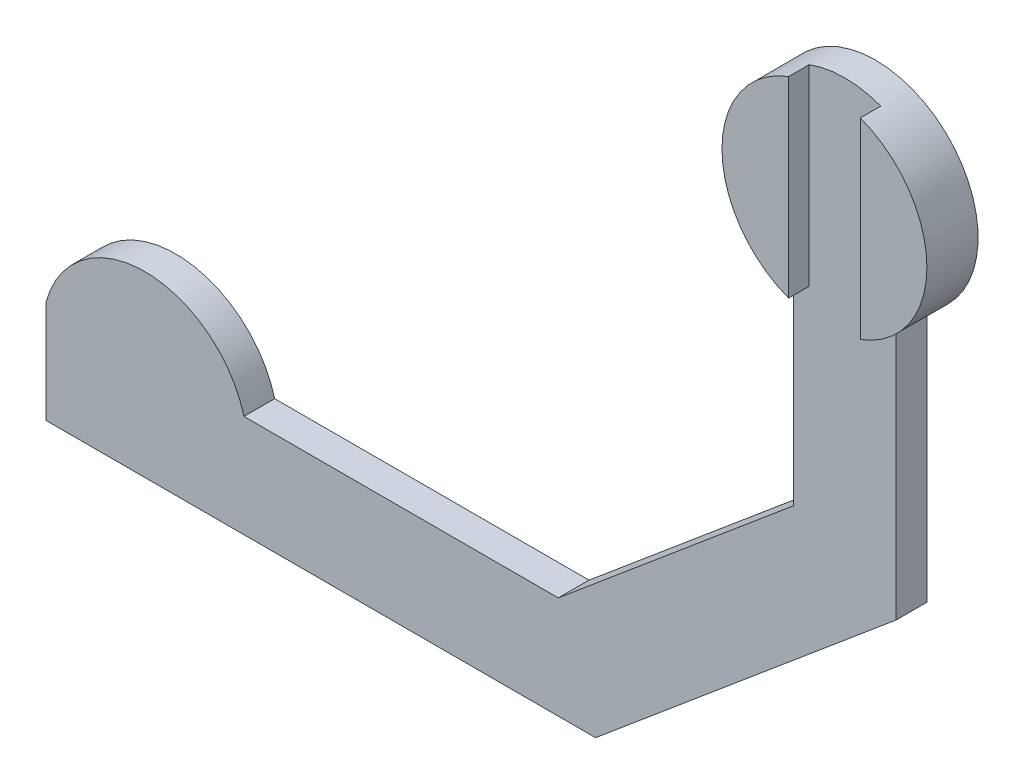
ISO-10303-21;
HEADER;
FILE_DESCRIPTION(('STEP AP214'),'2;1');
FILE_NAME('part.step','',(''),(''),'','','');
FILE_SCHEMA(('AUTOMOTIVE_DESIGN { 1 0 10303 214 1 1 1 1 }'));
ENDSEC;
DATA;
#1=APPLICATION_CONTEXT('core data for automotive mechanical design processes');
#2=APPLICATION_PROTOCOL_DEFINITION('international standard','automotive_design',2000,#1);
#3=PRODUCT_CONTEXT('',#1,'mechanical');
#4=PRODUCT('Part','Part','',(#3));
#5=PRODUCT_RELATED_PRODUCT_CATEGORY('part','',(#4));
#6=PRODUCT_DEFINITION_FORMATION('','',#4);
#7=PRODUCT_DEFINITION_CONTEXT('part definition',#1,'design');
#8=PRODUCT_DEFINITION('design','',#6,#7);
#9=PRODUCT_DEFINITION_SHAPE('','',#8);
#10=(LENGTH_UNIT() NAMED_UNIT(*) SI_UNIT(.MILLI.,.METRE.));
#11=(NAMED_UNIT(*) PLANE_ANGLE_UNIT() SI_UNIT($,.RADIAN.));
#12=(NAMED_UNIT(*) SI_UNIT($,.STERADIAN.) SOLID_ANGLE_UNIT());
#13=UNCERTAINTY_MEASURE_WITH_UNIT(LENGTH_MEASURE(1.E-05),#10,'distance_accuracy_value','');
#14=(GEOMETRIC_REPRESENTATION_CONTEXT(3) GLOBAL_UNCERTAINTY_ASSIGNED_CONTEXT((#13)) GLOBAL_UNIT_ASSIGNED_CONTEXT((#10,
#11,#12)) REPRESENTATION_CONTEXT('',''));
#15=CARTESIAN_POINT('',(0.,0.,0.));
#16=DIRECTION('',(0.,0.,1.));
#17=DIRECTION('',(1.,0.,0.));
#18=AXIS2_PLACEMENT_3D('',#15,#16,#17);
#19=CARTESIAN_POINT('',(0.,0.,3.));
#20=DIRECTION('',(0.,0.,1.));
#21=DIRECTION('',(1.,0.,0.));
#22=AXIS2_PLACEMENT_3D('',#19,#20,#21);
#23=PLANE('',#22);
#24=CARTESIAN_POINT('',(0.,0.,3.));
#25=DIRECTION('',(0.,0.,1.));
#26=DIRECTION('',(1.,0.,0.));
#27=AXIS2_PLACEMENT_3D('',#24,#25,#26);
#28=CIRCLE('',#27,10.);
#29=CARTESIAN_POINT('',(3.5,-9.3674969975976,3.));
#30=VERTEX_POINT('',#29);
#31=CARTESIAN_POINT('',(5.,-8.66025403784439,3.));
#32=VERTEX_POINT('',#31);
#33=EDGE_CURVE('E52',#30,#32,#28,.T.);
#34=ORIENTED_EDGE('',*,*,#33,.F.);
#35=DIRECTION('',(0.,-1.,0.));
#36=VECTOR('',#35,1.);
#37=CARTESIAN_POINT('',(3.5,0.,3.));
#38=LINE('',#37,#36);
#39=CARTESIAN_POINT('',(3.5,9.3674969975976,3.));
#40=VERTEX_POINT('',#39);
#41=EDGE_CURVE('E148',#40,#30,#38,.T.);
#42=ORIENTED_EDGE('',*,*,#41,.F.);
#43=CARTESIAN_POINT('',(0.,0.,3.));
#44=DIRECTION('',(0.,0.,1.));
#45=DIRECTION('',(1.,0.,0.));
#46=AXIS2_PLACEMENT_3D('',#43,#44,#45);
#47=CIRCLE('',#46,10.);
#48=CARTESIAN_POINT('',(-3.5,9.3674969975976,3.));
#49=VERTEX_POINT('',#48);
#50=EDGE_CURVE('E44',#40,#49,#47,.T.);
#51=ORIENTED_EDGE('',*,*,#50,.T.);
#52=DIRECTION('',(0.,-1.,0.));
#53=VECTOR('',#52,1.);
#54=CARTESIAN_POINT('',(-3.5,0.,3.));
#55=LINE('',#54,#53);
#56=CARTESIAN_POINT('',(-3.5,-9.3674969975976,3.));
#57=VERTEX_POINT('',#56);
#58=EDGE_CURVE('E149',#49,#57,#55,.T.);
#59=ORIENTED_EDGE('',*,*,#58,.T.);
#60=CARTESIAN_POINT('',(0.,0.,3.));
#61=DIRECTION('',(0.,0.,1.));
#62=DIRECTION('',(1.,0.,0.));
#63=AXIS2_PLACEMENT_3D('',#60,#61,#62);
#64=CIRCLE('',#63,10.);
#65=CARTESIAN_POINT('',(-5.,-8.66025403784439,3.));
#66=VERTEX_POINT('',#65);
#67=EDGE_CURVE('E11',#66,#57,#64,.T.);
#68=ORIENTED_EDGE('',*,*,#67,.F.);
#69=DIRECTION('',(0.,-1.,0.));
#70=VECTOR('',#69,1.);
#71=CARTESIAN_POINT('',(-5.,-28.6602540378444,3.));
#72=LINE('',#71,#70);
#73=CARTESIAN_POINT('',(-5.,-28.6602540378444,3.));
#74=VERTEX_POINT('',#73);
#75=EDGE_CURVE('E195',#66,#74,#72,.T.);
#76=ORIENTED_EDGE('',*,*,#75,.T.);
#77=DIRECTION('',(-0.766044443118977,-0.64278760968654,0.));
#78=VECTOR('',#77,1.);
#79=CARTESIAN_POINT('',(-27.9813332935693,-47.9438823284406,3.));
#80=LINE('',#79,#78);
#81=CARTESIAN_POINT('',(-27.9813332935693,-47.9438823284406,3.));
#82=VERTEX_POINT('',#81);
#83=EDGE_CURVE('E198',#74,#82,#80,.T.);
#84=ORIENTED_EDGE('',*,*,#83,.T.);
#85=DIRECTION('',(-1.,0.,0.));
#86=VECTOR('',#85,1.);
#87=CARTESIAN_POINT('',(-77.9813332935693,-47.9438823284406,3.));
#88=LINE('',#87,#86);
#89=CARTESIAN_POINT('',(-58.6628167677879,-47.9438823284406,3.));
#90=VERTEX_POINT('',#89);
#91=EDGE_CURVE('E201',#82,#90,#88,.T.);
#92=ORIENTED_EDGE('',*,*,#91,.T.);
#93=CARTESIAN_POINT('',(-68.3220750306786,-50.5320727794658,3.));
#94=DIRECTION('',(0.,0.,1.));
#95=DIRECTION('',(-1.,0.,0.));
#96=AXIS2_PLACEMENT_3D('',#93,#94,#95);
#97=CIRCLE('',#96,10.);
#98=CARTESIAN_POINT('',(-77.9813332935693,-47.9438823284406,3.));
#99=VERTEX_POINT('',#98);
#100=EDGE_CURVE('E164',#90,#99,#97,.T.);
#101=ORIENTED_EDGE('',*,*,#100,.T.);
#102=DIRECTION('',(0.,-1.,0.));
#103=VECTOR('',#102,1.);
#104=CARTESIAN_POINT('',(-77.9813332935693,-57.9438823284406,3.));
#105=LINE('',#104,#103);
#106=CARTESIAN_POINT('',(-77.9813332935693,-57.9438823284406,3.));
#107=VERTEX_POINT('',#106);
#108=EDGE_CURVE('E204',#99,#107,#105,.T.);
#109=ORIENTED_EDGE('',*,*,#108,.T.);
#110=DIRECTION('',(1.,0.,0.));
#111=VECTOR('',#110,1.);
#112=CARTESIAN_POINT('',(-24.3416309509073,-57.9438823284406,3.));
#113=LINE('',#112,#111);
#114=CARTESIAN_POINT('',(-24.3416309509073,-57.9438823284406,3.));
#115=VERTEX_POINT('',#114);
#116=EDGE_CURVE('E207',#107,#115,#113,.T.);
#117=ORIENTED_EDGE('',*,*,#116,.T.);
#118=DIRECTION('',(0.766044443118977,0.64278760968654,0.));
#119=VECTOR('',#118,1.);
#120=CARTESIAN_POINT('',(5.,-33.3233306193944,3.));
#121=LINE('',#120,#119);
#122=CARTESIAN_POINT('',(5.,-33.3233306193944,3.));
#123=VERTEX_POINT('',#122);
#124=EDGE_CURVE('E175',#115,#123,#121,.T.);
#125=ORIENTED_EDGE('',*,*,#124,.T.);
#126=DIRECTION('',(0.,1.,0.));
#127=VECTOR('',#126,1.);
#128=CARTESIAN_POINT('',(5.,-8.66025403784439,3.));
#129=LINE('',#128,#127);
#130=EDGE_CURVE('E171',#123,#32,#129,.T.);
#131=ORIENTED_EDGE('',*,*,#130,.T.);
#132=EDGE_LOOP('',(#34,#42,#51,#59,#68,#76,#84,#92,#101,#109,#117,#125,#131));
#133=FACE_BOUND('',#132,.T.);
#134=ADVANCED_FACE('F35',(#133),#23,.T.);
#135=CARTESIAN_POINT('',(0.,0.,3.));
#136=DIRECTION('',(0.,0.,-1.));
#137=DIRECTION('',(-1.,0.,0.));
#138=AXIS2_PLACEMENT_3D('',#135,#136,#137);
#139=CYLINDRICAL_SURFACE('',#138,10.);
#140=ORIENTED_EDGE('',*,*,#50,.F.);
#141=DIRECTION('',(0.,0.,-1.));
#142=VECTOR('',#141,1.);
#143=CARTESIAN_POINT('',(3.5,9.3674969975976,5.));
#144=LINE('',#143,#142);
#145=CARTESIAN_POINT('',(3.5,9.3674969975976,5.));
#146=VERTEX_POINT('',#145);
#147=EDGE_CURVE('E139',#146,#40,#144,.T.);
#148=ORIENTED_EDGE('',*,*,#147,.F.);
#149=CARTESIAN_POINT('',(0.,0.,5.));
#150=DIRECTION('',(0.,0.,1.));
#151=DIRECTION('',(1.,0.,0.));
#152=AXIS2_PLACEMENT_3D('',#149,#150,#151);
#153=CIRCLE('',#152,10.);
#154=CARTESIAN_POINT('',(3.5,-9.3674969975976,5.));
#155=VERTEX_POINT('',#154);
#156=EDGE_CURVE('E133',#155,#146,#153,.T.);
#157=ORIENTED_EDGE('',*,*,#156,.F.);
#158=DIRECTION('',(0.,0.,-1.));
#159=VECTOR('',#158,1.);
#160=CARTESIAN_POINT('',(3.5,-9.3674969975976,5.));
#161=LINE('',#160,#159);
#162=EDGE_CURVE('E136',#155,#30,#161,.T.);
#163=ORIENTED_EDGE('',*,*,#162,.T.);
#164=ORIENTED_EDGE('',*,*,#33,.T.);
#165=DIRECTION('',(0.,0.,1.));
#166=VECTOR('',#165,1.);
#167=CARTESIAN_POINT('',(5.,-8.66025403784439,0.));
#168=LINE('',#167,#166);
#169=CARTESIAN_POINT('',(5.,-8.66025403784439,0.));
#170=VERTEX_POINT('',#169);
#171=EDGE_CURVE('E193',#170,#32,#168,.T.);
#172=ORIENTED_EDGE('',*,*,#171,.F.);
#173=CARTESIAN_POINT('',(0.,0.,0.));
#174=DIRECTION('',(0.,0.,1.));
#175=DIRECTION('',(1.,0.,0.));
#176=AXIS2_PLACEMENT_3D('',#173,#174,#175);
#177=CIRCLE('',#176,10.);
#178=CARTESIAN_POINT('',(-5.,-8.66025403784439,0.));
#179=VERTEX_POINT('',#178);
#180=EDGE_CURVE('E39',#170,#179,#177,.T.);
#181=ORIENTED_EDGE('',*,*,#180,.T.);
#182=DIRECTION('',(0.,0.,1.));
#183=VECTOR('',#182,1.);
#184=CARTESIAN_POINT('',(-5.,-8.66025403784439,0.));
#185=LINE('',#184,#183);
#186=EDGE_CURVE('E225',#179,#66,#185,.T.);
#187=ORIENTED_EDGE('',*,*,#186,.T.);
#188=ORIENTED_EDGE('',*,*,#67,.T.);
#189=DIRECTION('',(0.,0.,-1.));
#190=VECTOR('',#189,1.);
#191=CARTESIAN_POINT('',(-3.5,-9.3674969975976,5.));
#192=LINE('',#191,#190);
#193=CARTESIAN_POINT('',(-3.5,-9.3674969975976,5.));
#194=VERTEX_POINT('',#193);
#195=EDGE_CURVE('E60',#194,#57,#192,.T.);
#196=ORIENTED_EDGE('',*,*,#195,.F.);
#197=CARTESIAN_POINT('',(0.,0.,5.));
#198=DIRECTION('',(0.,0.,1.));
#199=DIRECTION('',(1.,0.,0.));
#200=AXIS2_PLACEMENT_3D('',#197,#198,#199);
#201=CIRCLE('',#200,10.);
#202=CARTESIAN_POINT('',(-3.5,9.3674969975976,5.));
#203=VERTEX_POINT('',#202);
#204=EDGE_CURVE('E152',#203,#194,#201,.T.);
#205=ORIENTED_EDGE('',*,*,#204,.F.);
#206=DIRECTION('',(0.,0.,-1.));
#207=VECTOR('',#206,1.);
#208=CARTESIAN_POINT('',(-3.5,9.3674969975976,5.));
#209=LINE('',#208,#207);
#210=EDGE_CURVE('E159',#203,#49,#209,.T.);
#211=ORIENTED_EDGE('',*,*,#210,.T.);
#212=EDGE_LOOP('',(#140,#148,#157,#163,#164,#172,#181,#187,#188,#196,#205,#211));
#213=FACE_BOUND('',#212,.T.);
#214=ADVANCED_FACE('F37',(#213),#139,.T.);
#215=CARTESIAN_POINT('',(0.,0.,0.));
#216=DIRECTION('',(0.,0.,1.));
#217=DIRECTION('',(1.,0.,0.));
#218=AXIS2_PLACEMENT_3D('',#215,#216,#217);
#219=PLANE('',#218);
#220=ORIENTED_EDGE('',*,*,#180,.F.);
#221=DIRECTION('',(0.,1.,0.));
#222=VECTOR('',#221,1.);
#223=CARTESIAN_POINT('',(5.,-8.66025403784439,0.));
#224=LINE('',#223,#222);
#225=CARTESIAN_POINT('',(5.,-33.3233306193944,0.));
#226=VERTEX_POINT('',#225);
#227=EDGE_CURVE('E172',#226,#170,#224,.T.);
#228=ORIENTED_EDGE('',*,*,#227,.F.);
#229=DIRECTION('',(0.766044443118977,0.64278760968654,0.));
#230=VECTOR('',#229,1.);
#231=CARTESIAN_POINT('',(5.,-33.3233306193944,0.));
#232=LINE('',#231,#230);
#233=CARTESIAN_POINT('',(-24.3416309509073,-57.9438823284406,0.));
#234=VERTEX_POINT('',#233);
#235=EDGE_CURVE('E190',#234,#226,#232,.T.);
#236=ORIENTED_EDGE('',*,*,#235,.F.);
#237=DIRECTION('',(1.,0.,0.));
#238=VECTOR('',#237,1.);
#239=CARTESIAN_POINT('',(-24.3416309509073,-57.9438823284406,0.));
#240=LINE('',#239,#238);
#241=CARTESIAN_POINT('',(-77.9813332935693,-57.9438823284406,0.));
#242=VERTEX_POINT('',#241);
#243=EDGE_CURVE('E187',#242,#234,#240,.T.);
#244=ORIENTED_EDGE('',*,*,#243,.F.);
#245=DIRECTION('',(0.,-1.,0.));
#246=VECTOR('',#245,1.);
#247=CARTESIAN_POINT('',(-77.9813332935693,-57.9438823284406,0.));
#248=LINE('',#247,#246);
#249=CARTESIAN_POINT('',(-77.9813332935693,-47.9438823284406,0.));
#250=VERTEX_POINT('',#249);
#251=EDGE_CURVE('E184',#250,#242,#248,.T.);
#252=ORIENTED_EDGE('',*,*,#251,.F.);
#253=CARTESIAN_POINT('',(-68.3220750306786,-50.5320727794658,0.));
#254=DIRECTION('',(0.,0.,1.));
#255=DIRECTION('',(-1.,0.,0.));
#256=AXIS2_PLACEMENT_3D('',#253,#254,#255);
#257=CIRCLE('',#256,10.);
#258=CARTESIAN_POINT('',(-58.6628167677879,-47.9438823284406,0.));
#259=VERTEX_POINT('',#258);
#260=EDGE_CURVE('E165',#259,#250,#257,.T.);
#261=ORIENTED_EDGE('',*,*,#260,.F.);
#262=DIRECTION('',(-1.,0.,0.));
#263=VECTOR('',#262,1.);
#264=CARTESIAN_POINT('',(-77.9813332935693,-47.9438823284406,0.));
#265=LINE('',#264,#263);
#266=CARTESIAN_POINT('',(-27.9813332935693,-47.9438823284406,0.));
#267=VERTEX_POINT('',#266);
#268=EDGE_CURVE('E181',#267,#259,#265,.T.);
#269=ORIENTED_EDGE('',*,*,#268,.F.);
#270=DIRECTION('',(-0.766044443118977,-0.64278760968654,0.));
#271=VECTOR('',#270,1.);
#272=CARTESIAN_POINT('',(-27.9813332935693,-47.9438823284406,0.));
#273=LINE('',#272,#271);
#274=CARTESIAN_POINT('',(-5.,-28.6602540378444,0.));
#275=VERTEX_POINT('',#274);
#276=EDGE_CURVE('E178',#275,#267,#273,.T.);
#277=ORIENTED_EDGE('',*,*,#276,.F.);
#278=DIRECTION('',(0.,-1.,0.));
#279=VECTOR('',#278,1.);
#280=CARTESIAN_POINT('',(-5.,-28.6602540378444,0.));
#281=LINE('',#280,#279);
#282=EDGE_CURVE('E174',#179,#275,#281,.T.);
#283=ORIENTED_EDGE('',*,*,#282,.F.);
#284=EDGE_LOOP('',(#220,#228,#236,#244,#252,#261,#269,#277,#283));
#285=FACE_BOUND('',#284,.T.);
#286=ADVANCED_FACE('F235',(#285),#219,.F.);
#287=CARTESIAN_POINT('',(5.,-8.66025403784439,0.));
#288=DIRECTION('',(1.,0.,0.));
#289=DIRECTION('',(0.,1.,0.));
#290=AXIS2_PLACEMENT_3D('',#287,#288,#289);
#291=PLANE('',#290);
#292=ORIENTED_EDGE('',*,*,#130,.F.);
#293=DIRECTION('',(0.,0.,1.));
#294=VECTOR('',#293,1.);
#295=CARTESIAN_POINT('',(5.,-33.3233306193944,0.));
#296=LINE('',#295,#294);
#297=EDGE_CURVE('E212',#226,#123,#296,.T.);
#298=ORIENTED_EDGE('',*,*,#297,.F.);
#299=ORIENTED_EDGE('',*,*,#227,.T.);
#300=ORIENTED_EDGE('',*,*,#171,.T.);
#301=EDGE_LOOP('',(#292,#298,#299,#300));
#302=FACE_BOUND('',#301,.T.);
#303=ADVANCED_FACE('F263',(#302),#291,.T.);
#304=CARTESIAN_POINT('',(5.,-33.3233306193944,0.));
#305=DIRECTION('',(0.64278760968654,-0.766044443118977,0.));
#306=DIRECTION('',(0.766044443118977,0.64278760968654,0.));
#307=AXIS2_PLACEMENT_3D('',#304,#305,#306);
#308=PLANE('',#307);
#309=ORIENTED_EDGE('',*,*,#124,.F.);
#310=DIRECTION('',(0.,0.,1.));
#311=VECTOR('',#310,1.);
#312=CARTESIAN_POINT('',(-24.3416309509073,-57.9438823284406,0.));
#313=LINE('',#312,#311);
#314=EDGE_CURVE('E214',#234,#115,#313,.T.);
#315=ORIENTED_EDGE('',*,*,#314,.F.);
#316=ORIENTED_EDGE('',*,*,#235,.T.);
#317=ORIENTED_EDGE('',*,*,#297,.T.);
#318=EDGE_LOOP('',(#309,#315,#316,#317));
#319=FACE_BOUND('',#318,.T.);
#320=ADVANCED_FACE('F269',(#319),#308,.T.);
#321=CARTESIAN_POINT('',(-24.3416309509073,-57.9438823284406,0.));
#322=DIRECTION('',(0.,-1.,0.));
#323=DIRECTION('',(1.,0.,0.));
#324=AXIS2_PLACEMENT_3D('',#321,#322,#323);
#325=PLANE('',#324);
#326=ORIENTED_EDGE('',*,*,#116,.F.);
#327=DIRECTION('',(0.,0.,1.));
#328=VECTOR('',#327,1.);
#329=CARTESIAN_POINT('',(-77.9813332935693,-57.9438823284406,0.));
#330=LINE('',#329,#328);
#331=EDGE_CURVE('E216',#242,#107,#330,.T.);
#332=ORIENTED_EDGE('',*,*,#331,.F.);
#333=ORIENTED_EDGE('',*,*,#243,.T.);
#334=ORIENTED_EDGE('',*,*,#314,.T.);
#335=EDGE_LOOP('',(#326,#332,#333,#334));
#336=FACE_BOUND('',#335,.T.);
#337=ADVANCED_FACE('F274',(#336),#325,.T.);
#338=CARTESIAN_POINT('',(-77.9813332935693,-57.9438823284406,0.));
#339=DIRECTION('',(-1.,0.,0.));
#340=DIRECTION('',(0.,0.,1.));
#341=AXIS2_PLACEMENT_3D('',#338,#339,#340);
#342=PLANE('',#341);
#343=ORIENTED_EDGE('',*,*,#108,.F.);
#344=DIRECTION('',(0.,0.,1.));
#345=VECTOR('',#344,1.);
#346=CARTESIAN_POINT('',(-77.9813332935693,-47.9438823284406,0.));
#347=LINE('',#346,#345);
#348=EDGE_CURVE('E218',#250,#99,#347,.T.);
#349=ORIENTED_EDGE('',*,*,#348,.F.);
#350=ORIENTED_EDGE('',*,*,#251,.T.);
#351=ORIENTED_EDGE('',*,*,#331,.T.);
#352=EDGE_LOOP('',(#343,#349,#350,#351));
#353=FACE_BOUND('',#352,.T.);
#354=ADVANCED_FACE('F287',(#353),#342,.T.);
#355=CARTESIAN_POINT('',(-77.9813332935693,-47.9438823284406,0.));
#356=DIRECTION('',(0.,1.,0.));
#357=DIRECTION('',(-1.,0.,0.));
#358=AXIS2_PLACEMENT_3D('',#355,#356,#357);
#359=PLANE('',#358);
#360=DIRECTION('',(0.,0.,1.));
#361=VECTOR('',#360,1.);
#362=CARTESIAN_POINT('',(-58.6628167677879,-47.9438823284406,0.));
#363=LINE('',#362,#361);
#364=EDGE_CURVE('E167',#259,#90,#363,.T.);
#365=ORIENTED_EDGE('',*,*,#364,.T.);
#366=ORIENTED_EDGE('',*,*,#91,.F.);
#367=DIRECTION('',(0.,0.,1.));
#368=VECTOR('',#367,1.);
#369=CARTESIAN_POINT('',(-27.9813332935693,-47.9438823284406,0.));
#370=LINE('',#369,#368);
#371=EDGE_CURVE('E221',#267,#82,#370,.T.);
#372=ORIENTED_EDGE('',*,*,#371,.F.);
#373=ORIENTED_EDGE('',*,*,#268,.T.);
#374=EDGE_LOOP('',(#365,#366,#372,#373));
#375=FACE_BOUND('',#374,.T.);
#376=ADVANCED_FACE('F290',(#375),#359,.T.);
#377=CARTESIAN_POINT('',(-27.9813332935693,-47.9438823284406,0.));
#378=DIRECTION('',(-0.64278760968654,0.766044443118977,0.));
#379=DIRECTION('',(-0.766044443118977,-0.64278760968654,0.));
#380=AXIS2_PLACEMENT_3D('',#377,#378,#379);
#381=PLANE('',#380);
#382=ORIENTED_EDGE('',*,*,#83,.F.);
#383=DIRECTION('',(0.,0.,1.));
#384=VECTOR('',#383,1.);
#385=CARTESIAN_POINT('',(-5.,-28.6602540378444,0.));
#386=LINE('',#385,#384);
#387=EDGE_CURVE('E223',#275,#74,#386,.T.);
#388=ORIENTED_EDGE('',*,*,#387,.F.);
#389=ORIENTED_EDGE('',*,*,#276,.T.);
#390=ORIENTED_EDGE('',*,*,#371,.T.);
#391=EDGE_LOOP('',(#382,#388,#389,#390));
#392=FACE_BOUND('',#391,.T.);
#393=ADVANCED_FACE('F293',(#392),#381,.T.);
#394=CARTESIAN_POINT('',(-5.,-28.6602540378444,0.));
#395=DIRECTION('',(-1.,0.,0.));
#396=DIRECTION('',(0.,-1.,0.));
#397=AXIS2_PLACEMENT_3D('',#394,#395,#396);
#398=PLANE('',#397);
#399=ORIENTED_EDGE('',*,*,#75,.F.);
#400=ORIENTED_EDGE('',*,*,#186,.F.);
#401=ORIENTED_EDGE('',*,*,#282,.T.);
#402=ORIENTED_EDGE('',*,*,#387,.T.);
#403=EDGE_LOOP('',(#399,#400,#401,#402));
#404=FACE_BOUND('',#403,.T.);
#405=ADVANCED_FACE('F241',(#404),#398,.T.);
#406=CARTESIAN_POINT('',(-68.3220750306786,-50.5320727794658,0.));
#407=DIRECTION('',(0.,0.,1.));
#408=DIRECTION('',(1.,0.,0.));
#409=AXIS2_PLACEMENT_3D('',#406,#407,#408);
#410=CYLINDRICAL_SURFACE('',#409,10.);
#411=ORIENTED_EDGE('',*,*,#100,.F.);
#412=ORIENTED_EDGE('',*,*,#364,.F.);
#413=ORIENTED_EDGE('',*,*,#260,.T.);
#414=ORIENTED_EDGE('',*,*,#348,.T.);
#415=EDGE_LOOP('',(#411,#412,#413,#414));
#416=FACE_BOUND('',#415,.T.);
#417=ADVANCED_FACE('F255',(#416),#410,.T.);
#418=CARTESIAN_POINT('',(-3.5,0.,5.));
#419=DIRECTION('',(1.,0.,0.));
#420=DIRECTION('',(0.,0.,-1.));
#421=AXIS2_PLACEMENT_3D('',#418,#419,#420);
#422=PLANE('',#421);
#423=ORIENTED_EDGE('',*,*,#58,.F.);
#424=ORIENTED_EDGE('',*,*,#210,.F.);
#425=DIRECTION('',(0.,-1.,0.));
#426=VECTOR('',#425,1.);
#427=CARTESIAN_POINT('',(-3.5,0.,5.));
#428=LINE('',#427,#426);
#429=EDGE_CURVE('E158',#203,#194,#428,.T.);
#430=ORIENTED_EDGE('',*,*,#429,.T.);
#431=ORIENTED_EDGE('',*,*,#195,.T.);
#432=EDGE_LOOP('',(#423,#424,#430,#431));
#433=FACE_BOUND('',#432,.T.);
#434=ADVANCED_FACE('F245',(#433),#422,.T.);
#435=CARTESIAN_POINT('',(0.,0.,5.));
#436=DIRECTION('',(0.,0.,1.));
#437=DIRECTION('',(1.,0.,0.));
#438=AXIS2_PLACEMENT_3D('',#435,#436,#437);
#439=PLANE('',#438);
#440=ORIENTED_EDGE('',*,*,#204,.T.);
#441=ORIENTED_EDGE('',*,*,#429,.F.);
#442=EDGE_LOOP('',(#440,#441));
#443=FACE_BOUND('',#442,.T.);
#444=ADVANCED_FACE('F247',(#443),#439,.T.);
#445=CARTESIAN_POINT('',(3.5,0.,5.));
#446=DIRECTION('',(1.,0.,0.));
#447=DIRECTION('',(0.,1.,0.));
#448=AXIS2_PLACEMENT_3D('',#445,#446,#447);
#449=PLANE('',#448);
#450=ORIENTED_EDGE('',*,*,#41,.T.);
#451=ORIENTED_EDGE('',*,*,#162,.F.);
#452=DIRECTION('',(0.,-1.,0.));
#453=VECTOR('',#452,1.);
#454=CARTESIAN_POINT('',(3.5,0.,5.));
#455=LINE('',#454,#453);
#456=EDGE_CURVE('E142',#146,#155,#455,.T.);
#457=ORIENTED_EDGE('',*,*,#456,.F.);
#458=ORIENTED_EDGE('',*,*,#147,.T.);
#459=EDGE_LOOP('',(#450,#451,#457,#458));
#460=FACE_BOUND('',#459,.T.);
#461=ADVANCED_FACE('F147',(#460),#449,.F.);
#462=CARTESIAN_POINT('',(0.,0.,5.));
#463=DIRECTION('',(0.,0.,1.));
#464=DIRECTION('',(1.,0.,0.));
#465=AXIS2_PLACEMENT_3D('',#462,#463,#464);
#466=PLANE('',#465);
#467=ORIENTED_EDGE('',*,*,#456,.T.);
#468=ORIENTED_EDGE('',*,*,#156,.T.);
#469=EDGE_LOOP('',(#467,#468));
#470=FACE_BOUND('',#469,.T.);
#471=ADVANCED_FACE('F144',(#470),#466,.T.);
#472=CLOSED_SHELL('',(#134,#214,#286,#303,#320,#337,#354,#376,#393,#405,#417,#434,#444,#461,#471));
#473=MANIFOLD_SOLID_BREP('B2',#472);
#474=ADVANCED_BREP_SHAPE_REPRESENTATION('',(#18,#473),#14);
#475=SHAPE_DEFINITION_REPRESENTATION(#9,#474);
ENDSEC;
END-ISO-10303-21;
